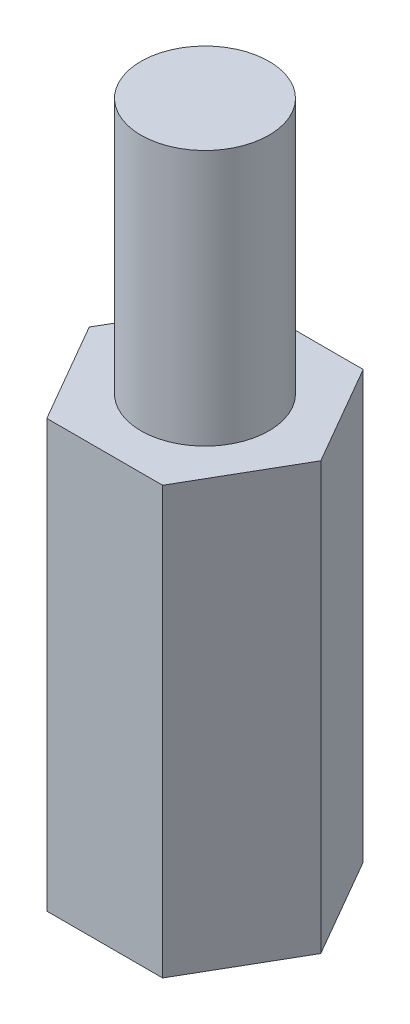
ISO-10303-21;
HEADER;
FILE_DESCRIPTION(('STEP AP214'),'2;1');
FILE_NAME('part.step','',(''),(''),'','','');
FILE_SCHEMA(('AUTOMOTIVE_DESIGN { 1 0 10303 214 1 1 1 1 }'));
ENDSEC;
DATA;
#1=APPLICATION_CONTEXT('core data for automotive mechanical design processes');
#2=APPLICATION_PROTOCOL_DEFINITION('international standard','automotive_design',2000,#1);
#3=PRODUCT_CONTEXT('',#1,'mechanical');
#4=PRODUCT('Part','Part','',(#3));
#5=PRODUCT_RELATED_PRODUCT_CATEGORY('part','',(#4));
#6=PRODUCT_DEFINITION_FORMATION('','',#4);
#7=PRODUCT_DEFINITION_CONTEXT('part definition',#1,'design');
#8=PRODUCT_DEFINITION('design','',#6,#7);
#9=PRODUCT_DEFINITION_SHAPE('','',#8);
#10=(LENGTH_UNIT() NAMED_UNIT(*) SI_UNIT(.MILLI.,.METRE.));
#11=(NAMED_UNIT(*) PLANE_ANGLE_UNIT() SI_UNIT($,.RADIAN.));
#12=(NAMED_UNIT(*) SI_UNIT($,.STERADIAN.) SOLID_ANGLE_UNIT());
#13=UNCERTAINTY_MEASURE_WITH_UNIT(LENGTH_MEASURE(1.E-05),#10,'distance_accuracy_value','');
#14=(GEOMETRIC_REPRESENTATION_CONTEXT(3) GLOBAL_UNCERTAINTY_ASSIGNED_CONTEXT((#13)) GLOBAL_UNIT_ASSIGNED_CONTEXT((#10,
#11,#12)) REPRESENTATION_CONTEXT('',''));
#15=CARTESIAN_POINT('',(0.,0.,0.));
#16=DIRECTION('',(0.,0.,1.));
#17=DIRECTION('',(1.,0.,0.));
#18=AXIS2_PLACEMENT_3D('',#15,#16,#17);
#19=CARTESIAN_POINT('',(0.,10.,0.));
#20=DIRECTION('',(0.,1.,0.));
#21=DIRECTION('',(0.,0.,1.));
#22=AXIS2_PLACEMENT_3D('',#19,#20,#21);
#23=PLANE('',#22);
#24=DIRECTION('',(0.5,0.,-0.866025403784439));
#25=VECTOR('',#24,1.);
#26=CARTESIAN_POINT('',(1.35677313259563,10.,2.35));
#27=LINE('',#26,#25);
#28=CARTESIAN_POINT('',(1.35677313259563,10.,2.35));
#29=VERTEX_POINT('',#28);
#30=CARTESIAN_POINT('',(2.71354626519124,10.,0.));
#31=VERTEX_POINT('',#30);
#32=EDGE_CURVE('E128',#29,#31,#27,.T.);
#33=ORIENTED_EDGE('',*,*,#32,.T.);
#34=DIRECTION('',(-0.500000000000001,0.,-0.866025403784438));
#35=VECTOR('',#34,1.);
#36=CARTESIAN_POINT('',(2.71354626519124,10.,0.));
#37=LINE('',#36,#35);
#38=CARTESIAN_POINT('',(1.35677313259561,10.,-2.35));
#39=VERTEX_POINT('',#38);
#40=EDGE_CURVE('E86',#31,#39,#37,.T.);
#41=ORIENTED_EDGE('',*,*,#40,.T.);
#42=DIRECTION('',(-1.,0.,0.));
#43=VECTOR('',#42,1.);
#44=CARTESIAN_POINT('',(1.35677313259561,10.,-2.35));
#45=LINE('',#44,#43);
#46=CARTESIAN_POINT('',(-1.35677313259562,10.,-2.35));
#47=VERTEX_POINT('',#46);
#48=EDGE_CURVE('E99',#39,#47,#45,.T.);
#49=ORIENTED_EDGE('',*,*,#48,.T.);
#50=DIRECTION('',(-0.5,0.,0.866025403784439));
#51=VECTOR('',#50,1.);
#52=CARTESIAN_POINT('',(-1.35677313259562,10.,-2.35));
#53=LINE('',#52,#51);
#54=CARTESIAN_POINT('',(-2.71354626519124,10.,0.));
#55=VERTEX_POINT('',#54);
#56=EDGE_CURVE('E93',#47,#55,#53,.T.);
#57=ORIENTED_EDGE('',*,*,#56,.T.);
#58=DIRECTION('',(0.5,0.,0.866025403784439));
#59=VECTOR('',#58,1.);
#60=CARTESIAN_POINT('',(-2.71354626519124,10.,0.));
#61=LINE('',#60,#59);
#62=CARTESIAN_POINT('',(-1.35677313259562,10.,2.35));
#63=VERTEX_POINT('',#62);
#64=EDGE_CURVE('E97',#55,#63,#61,.T.);
#65=ORIENTED_EDGE('',*,*,#64,.T.);
#66=DIRECTION('',(1.,0.,0.));
#67=VECTOR('',#66,1.);
#68=CARTESIAN_POINT('',(-1.35677313259562,10.,2.35));
#69=LINE('',#68,#67);
#70=EDGE_CURVE('E49',#63,#29,#69,.T.);
#71=ORIENTED_EDGE('',*,*,#70,.T.);
#72=EDGE_LOOP('',(#33,#41,#49,#57,#65,#71));
#73=FACE_BOUND('',#72,.T.);
#74=CARTESIAN_POINT('',(0.,10.,0.));
#75=DIRECTION('',(0.,1.,0.));
#76=DIRECTION('',(0.,0.,1.));
#77=AXIS2_PLACEMENT_3D('',#74,#75,#76);
#78=CIRCLE('',#77,1.5);
#79=CARTESIAN_POINT('',(0.,10.,1.5));
#80=VERTEX_POINT('',#79);
#81=EDGE_CURVE('E178',#80,#80,#78,.T.);
#82=ORIENTED_EDGE('',*,*,#81,.F.);
#83=EDGE_LOOP('',(#82));
#84=FACE_BOUND('',#83,.T.);
#85=ADVANCED_FACE('F32',(#73,#84),#23,.T.);
#86=CARTESIAN_POINT('',(1.35677313259563,10.,2.35));
#87=DIRECTION('',(-0.866025403784439,0.,-0.5));
#88=DIRECTION('',(-0.5,0.,0.866025403784439));
#89=AXIS2_PLACEMENT_3D('',#86,#87,#88);
#90=PLANE('',#89);
#91=DIRECTION('',(0.5,0.,-0.866025403784439));
#92=VECTOR('',#91,1.);
#93=CARTESIAN_POINT('',(1.35677313259563,0.,2.35));
#94=LINE('',#93,#92);
#95=CARTESIAN_POINT('',(1.35677313259563,0.,2.35));
#96=VERTEX_POINT('',#95);
#97=CARTESIAN_POINT('',(2.71354626519124,0.,0.));
#98=VERTEX_POINT('',#97);
#99=EDGE_CURVE('E117',#96,#98,#94,.T.);
#100=ORIENTED_EDGE('',*,*,#99,.T.);
#101=DIRECTION('',(0.,-1.,0.));
#102=VECTOR('',#101,1.);
#103=CARTESIAN_POINT('',(2.71354626519124,10.,0.));
#104=LINE('',#103,#102);
#105=EDGE_CURVE('E11',#31,#98,#104,.T.);
#106=ORIENTED_EDGE('',*,*,#105,.F.);
#107=ORIENTED_EDGE('',*,*,#32,.F.);
#108=DIRECTION('',(0.,-1.,0.));
#109=VECTOR('',#108,1.);
#110=CARTESIAN_POINT('',(1.35677313259563,10.,2.35));
#111=LINE('',#110,#109);
#112=EDGE_CURVE('E113',#29,#96,#111,.T.);
#113=ORIENTED_EDGE('',*,*,#112,.T.);
#114=EDGE_LOOP('',(#100,#106,#107,#113));
#115=FACE_BOUND('',#114,.T.);
#116=ADVANCED_FACE('F34',(#115),#90,.F.);
#117=CARTESIAN_POINT('',(2.71354626519124,10.,0.));
#118=DIRECTION('',(-0.866025403784438,0.,0.500000000000001));
#119=DIRECTION('',(0.500000000000001,0.,0.866025403784438));
#120=AXIS2_PLACEMENT_3D('',#117,#118,#119);
#121=PLANE('',#120);
#122=DIRECTION('',(-0.500000000000001,0.,-0.866025403784438));
#123=VECTOR('',#122,1.);
#124=CARTESIAN_POINT('',(2.71354626519124,0.,0.));
#125=LINE('',#124,#123);
#126=CARTESIAN_POINT('',(1.35677313259561,0.,-2.35));
#127=VERTEX_POINT('',#126);
#128=EDGE_CURVE('E120',#98,#127,#125,.T.);
#129=ORIENTED_EDGE('',*,*,#128,.T.);
#130=DIRECTION('',(0.,-1.,0.));
#131=VECTOR('',#130,1.);
#132=CARTESIAN_POINT('',(1.35677313259561,10.,-2.35));
#133=LINE('',#132,#131);
#134=EDGE_CURVE('E41',#39,#127,#133,.T.);
#135=ORIENTED_EDGE('',*,*,#134,.F.);
#136=ORIENTED_EDGE('',*,*,#40,.F.);
#137=ORIENTED_EDGE('',*,*,#105,.T.);
#138=EDGE_LOOP('',(#129,#135,#136,#137));
#139=FACE_BOUND('',#138,.T.);
#140=ADVANCED_FACE('F157',(#139),#121,.F.);
#141=CARTESIAN_POINT('',(1.35677313259561,10.,-2.35));
#142=DIRECTION('',(0.,0.,1.));
#143=DIRECTION('',(1.,0.,0.));
#144=AXIS2_PLACEMENT_3D('',#141,#142,#143);
#145=PLANE('',#144);
#146=DIRECTION('',(-1.,0.,0.));
#147=VECTOR('',#146,1.);
#148=CARTESIAN_POINT('',(1.35677313259561,0.,-2.35));
#149=LINE('',#148,#147);
#150=CARTESIAN_POINT('',(-1.35677313259562,0.,-2.35));
#151=VERTEX_POINT('',#150);
#152=EDGE_CURVE('E123',#127,#151,#149,.T.);
#153=ORIENTED_EDGE('',*,*,#152,.T.);
#154=DIRECTION('',(0.,-1.,0.));
#155=VECTOR('',#154,1.);
#156=CARTESIAN_POINT('',(-1.35677313259562,10.,-2.35));
#157=LINE('',#156,#155);
#158=EDGE_CURVE('E108',#47,#151,#157,.T.);
#159=ORIENTED_EDGE('',*,*,#158,.F.);
#160=ORIENTED_EDGE('',*,*,#48,.F.);
#161=ORIENTED_EDGE('',*,*,#134,.T.);
#162=EDGE_LOOP('',(#153,#159,#160,#161));
#163=FACE_BOUND('',#162,.T.);
#164=ADVANCED_FACE('F134',(#163),#145,.F.);
#165=CARTESIAN_POINT('',(-1.35677313259562,10.,-2.35));
#166=DIRECTION('',(0.866025403784439,0.,0.5));
#167=DIRECTION('',(0.5,0.,-0.866025403784439));
#168=AXIS2_PLACEMENT_3D('',#165,#166,#167);
#169=PLANE('',#168);
#170=DIRECTION('',(-0.5,0.,0.866025403784439));
#171=VECTOR('',#170,1.);
#172=CARTESIAN_POINT('',(-1.35677313259562,0.,-2.35));
#173=LINE('',#172,#171);
#174=CARTESIAN_POINT('',(-2.71354626519124,0.,0.));
#175=VERTEX_POINT('',#174);
#176=EDGE_CURVE('E107',#151,#175,#173,.T.);
#177=ORIENTED_EDGE('',*,*,#176,.T.);
#178=DIRECTION('',(0.,-1.,0.));
#179=VECTOR('',#178,1.);
#180=CARTESIAN_POINT('',(-2.71354626519124,10.,0.));
#181=LINE('',#180,#179);
#182=EDGE_CURVE('E104',#55,#175,#181,.T.);
#183=ORIENTED_EDGE('',*,*,#182,.F.);
#184=ORIENTED_EDGE('',*,*,#56,.F.);
#185=ORIENTED_EDGE('',*,*,#158,.T.);
#186=EDGE_LOOP('',(#177,#183,#184,#185));
#187=FACE_BOUND('',#186,.T.);
#188=ADVANCED_FACE('F105',(#187),#169,.F.);
#189=CARTESIAN_POINT('',(-2.71354626519124,10.,0.));
#190=DIRECTION('',(0.866025403784439,0.,-0.5));
#191=DIRECTION('',(-0.5,0.,-0.866025403784439));
#192=AXIS2_PLACEMENT_3D('',#189,#190,#191);
#193=PLANE('',#192);
#194=DIRECTION('',(0.5,0.,0.866025403784439));
#195=VECTOR('',#194,1.);
#196=CARTESIAN_POINT('',(-2.71354626519124,0.,0.));
#197=LINE('',#196,#195);
#198=CARTESIAN_POINT('',(-1.35677313259562,0.,2.35));
#199=VERTEX_POINT('',#198);
#200=EDGE_CURVE('E72',#175,#199,#197,.T.);
#201=ORIENTED_EDGE('',*,*,#200,.T.);
#202=DIRECTION('',(0.,-1.,0.));
#203=VECTOR('',#202,1.);
#204=CARTESIAN_POINT('',(-1.35677313259562,10.,2.35));
#205=LINE('',#204,#203);
#206=EDGE_CURVE('E109',#63,#199,#205,.T.);
#207=ORIENTED_EDGE('',*,*,#206,.F.);
#208=ORIENTED_EDGE('',*,*,#64,.F.);
#209=ORIENTED_EDGE('',*,*,#182,.T.);
#210=EDGE_LOOP('',(#201,#207,#208,#209));
#211=FACE_BOUND('',#210,.T.);
#212=ADVANCED_FACE('F111',(#211),#193,.F.);
#213=CARTESIAN_POINT('',(-1.35677313259562,10.,2.35));
#214=DIRECTION('',(0.,0.,-1.));
#215=DIRECTION('',(-1.,0.,0.));
#216=AXIS2_PLACEMENT_3D('',#213,#214,#215);
#217=PLANE('',#216);
#218=DIRECTION('',(1.,0.,0.));
#219=VECTOR('',#218,1.);
#220=CARTESIAN_POINT('',(-1.35677313259562,0.,2.35));
#221=LINE('',#220,#219);
#222=EDGE_CURVE('E78',#199,#96,#221,.T.);
#223=ORIENTED_EDGE('',*,*,#222,.T.);
#224=ORIENTED_EDGE('',*,*,#112,.F.);
#225=ORIENTED_EDGE('',*,*,#70,.F.);
#226=ORIENTED_EDGE('',*,*,#206,.T.);
#227=EDGE_LOOP('',(#223,#224,#225,#226));
#228=FACE_BOUND('',#227,.T.);
#229=ADVANCED_FACE('F141',(#228),#217,.F.);
#230=CARTESIAN_POINT('',(0.,0.,0.));
#231=DIRECTION('',(0.,1.,0.));
#232=DIRECTION('',(0.,0.,1.));
#233=AXIS2_PLACEMENT_3D('',#230,#231,#232);
#234=PLANE('',#233);
#235=CARTESIAN_POINT('',(0.,0.,0.));
#236=DIRECTION('',(0.,-1.,0.));
#237=DIRECTION('',(0.,0.,-1.));
#238=AXIS2_PLACEMENT_3D('',#235,#236,#237);
#239=CIRCLE('',#238,1.25);
#240=CARTESIAN_POINT('',(0.,0.,-1.25));
#241=VERTEX_POINT('',#240);
#242=EDGE_CURVE('E179',#241,#241,#239,.T.);
#243=ORIENTED_EDGE('',*,*,#242,.F.);
#244=EDGE_LOOP('',(#243));
#245=FACE_BOUND('',#244,.T.);
#246=ORIENTED_EDGE('',*,*,#99,.F.);
#247=ORIENTED_EDGE('',*,*,#222,.F.);
#248=ORIENTED_EDGE('',*,*,#200,.F.);
#249=ORIENTED_EDGE('',*,*,#176,.F.);
#250=ORIENTED_EDGE('',*,*,#152,.F.);
#251=ORIENTED_EDGE('',*,*,#128,.F.);
#252=EDGE_LOOP('',(#246,#247,#248,#249,#250,#251));
#253=FACE_BOUND('',#252,.T.);
#254=ADVANCED_FACE('F137',(#245,#253),#234,.F.);
#255=CARTESIAN_POINT('',(0.,16.,0.));
#256=DIRECTION('',(0.,-1.,0.));
#257=DIRECTION('',(0.,0.,-1.));
#258=AXIS2_PLACEMENT_3D('',#255,#256,#257);
#259=CYLINDRICAL_SURFACE('',#258,1.5);
#260=CARTESIAN_POINT('',(0.,16.,0.));
#261=DIRECTION('',(0.,1.,0.));
#262=DIRECTION('',(0.,0.,1.));
#263=AXIS2_PLACEMENT_3D('',#260,#261,#262);
#264=CIRCLE('',#263,1.5);
#265=CARTESIAN_POINT('',(0.,16.,1.5));
#266=VERTEX_POINT('',#265);
#267=EDGE_CURVE('E121',#266,#266,#264,.T.);
#268=ORIENTED_EDGE('',*,*,#267,.F.);
#269=EDGE_LOOP('',(#268));
#270=FACE_BOUND('',#269,.T.);
#271=ORIENTED_EDGE('',*,*,#81,.T.);
#272=EDGE_LOOP('',(#271));
#273=FACE_BOUND('',#272,.T.);
#274=ADVANCED_FACE('F148',(#270,#273),#259,.T.);
#275=CARTESIAN_POINT('',(0.,16.,0.));
#276=DIRECTION('',(0.,1.,0.));
#277=DIRECTION('',(0.,0.,1.));
#278=AXIS2_PLACEMENT_3D('',#275,#276,#277);
#279=PLANE('',#278);
#280=ORIENTED_EDGE('',*,*,#267,.T.);
#281=EDGE_LOOP('',(#280));
#282=FACE_BOUND('',#281,.T.);
#283=ADVANCED_FACE('F161',(#282),#279,.T.);
#284=CARTESIAN_POINT('',(0.,6.,0.));
#285=DIRECTION('',(0.,-1.,0.));
#286=DIRECTION('',(0.,0.,-1.));
#287=AXIS2_PLACEMENT_3D('',#284,#285,#286);
#288=CYLINDRICAL_SURFACE('',#287,1.25);
#289=CARTESIAN_POINT('',(0.,6.,0.));
#290=DIRECTION('',(0.,-1.,0.));
#291=DIRECTION('',(0.,0.,-1.));
#292=AXIS2_PLACEMENT_3D('',#289,#290,#291);
#293=CIRCLE('',#292,1.25);
#294=CARTESIAN_POINT('',(0.,6.,-1.25));
#295=VERTEX_POINT('',#294);
#296=EDGE_CURVE('E177',#295,#295,#293,.T.);
#297=ORIENTED_EDGE('',*,*,#296,.F.);
#298=EDGE_LOOP('',(#297));
#299=FACE_BOUND('',#298,.T.);
#300=ORIENTED_EDGE('',*,*,#242,.T.);
#301=EDGE_LOOP('',(#300));
#302=FACE_BOUND('',#301,.T.);
#303=ADVANCED_FACE('F165',(#299,#302),#288,.F.);
#304=CARTESIAN_POINT('',(0.,6.,0.));
#305=DIRECTION('',(0.,-1.,0.));
#306=DIRECTION('',(0.,0.,-1.));
#307=AXIS2_PLACEMENT_3D('',#304,#305,#306);
#308=PLANE('',#307);
#309=ORIENTED_EDGE('',*,*,#296,.T.);
#310=EDGE_LOOP('',(#309));
#311=FACE_BOUND('',#310,.T.);
#312=ADVANCED_FACE('F169',(#311),#308,.T.);
#313=CLOSED_SHELL('',(#85,#116,#140,#164,#188,#212,#229,#254,#274,#283,#303,#312));
#314=MANIFOLD_SOLID_BREP('B2',#313);
#315=ADVANCED_BREP_SHAPE_REPRESENTATION('',(#18,#314),#14);
#316=SHAPE_DEFINITION_REPRESENTATION(#9,#315);
ENDSEC;
END-ISO-10303-21;
